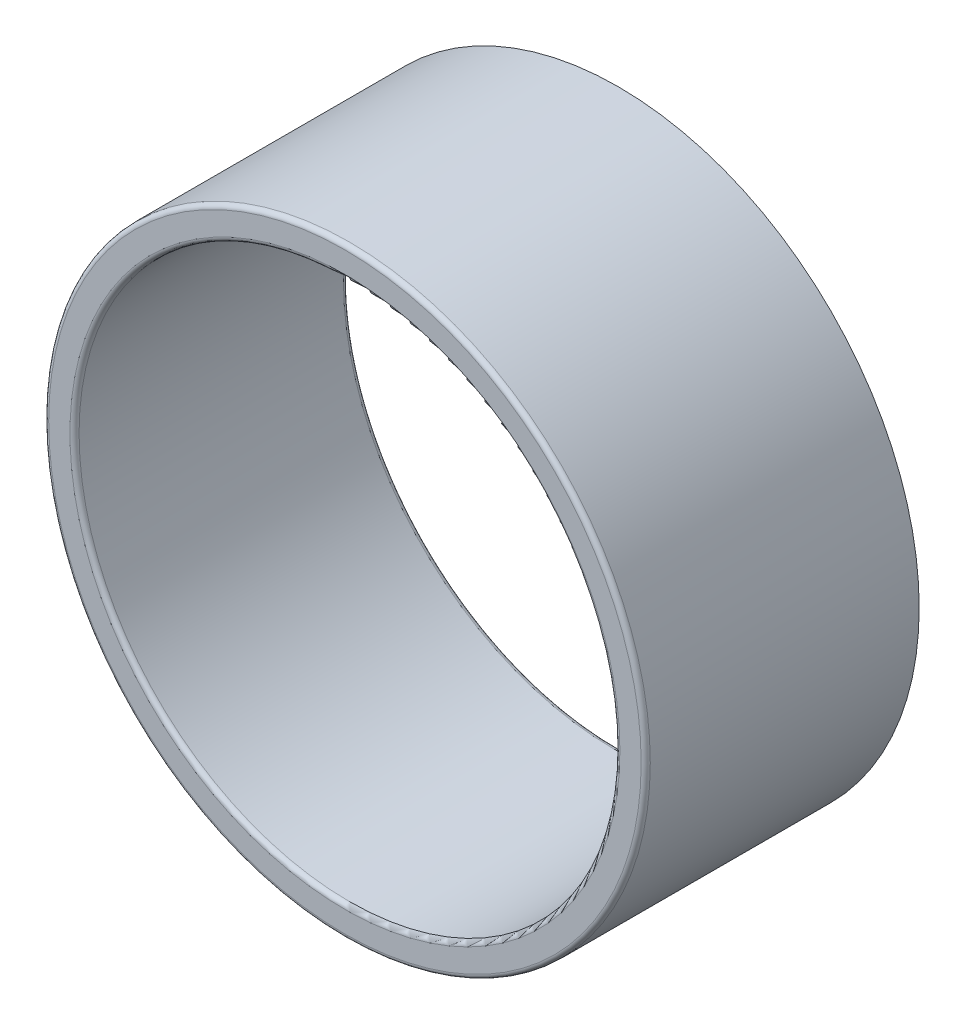
ISO-10303-21;
HEADER;
FILE_DESCRIPTION(('STEP AP214'),'2;1');
FILE_NAME('part.step','',(''),(''),'','','');
FILE_SCHEMA(('AUTOMOTIVE_DESIGN { 1 0 10303 214 1 1 1 1 }'));
ENDSEC;
DATA;
#1=APPLICATION_CONTEXT('core data for automotive mechanical design processes');
#2=APPLICATION_PROTOCOL_DEFINITION('international standard','automotive_design',2000,#1);
#3=PRODUCT_CONTEXT('',#1,'mechanical');
#4=PRODUCT('Part','Part','',(#3));
#5=PRODUCT_RELATED_PRODUCT_CATEGORY('part','',(#4));
#6=PRODUCT_DEFINITION_FORMATION('','',#4);
#7=PRODUCT_DEFINITION_CONTEXT('part definition',#1,'design');
#8=PRODUCT_DEFINITION('design','',#6,#7);
#9=PRODUCT_DEFINITION_SHAPE('','',#8);
#10=(LENGTH_UNIT() NAMED_UNIT(*) SI_UNIT(.MILLI.,.METRE.));
#11=(NAMED_UNIT(*) PLANE_ANGLE_UNIT() SI_UNIT($,.RADIAN.));
#12=(NAMED_UNIT(*) SI_UNIT($,.STERADIAN.) SOLID_ANGLE_UNIT());
#13=UNCERTAINTY_MEASURE_WITH_UNIT(LENGTH_MEASURE(1.E-05),#10,'distance_accuracy_value','');
#14=(GEOMETRIC_REPRESENTATION_CONTEXT(3) GLOBAL_UNCERTAINTY_ASSIGNED_CONTEXT((#13)) GLOBAL_UNIT_ASSIGNED_CONTEXT((#10,
#11,#12)) REPRESENTATION_CONTEXT('',''));
#15=CARTESIAN_POINT('',(0.,0.,0.));
#16=DIRECTION('',(0.,0.,1.));
#17=DIRECTION('',(1.,0.,0.));
#18=AXIS2_PLACEMENT_3D('',#15,#16,#17);
#19=CARTESIAN_POINT('',(232.735026918962,15.,-90.));
#20=DIRECTION('',(0.,0.,1.));
#21=DIRECTION('',(1.,0.,0.));
#22=AXIS2_PLACEMENT_3D('',#19,#20,#21);
#23=CYLINDRICAL_SURFACE('',#22,99.);
#24=CARTESIAN_POINT('',(232.735026918962,15.,-1.5));
#25=DIRECTION('',(0.,0.,1.));
#26=DIRECTION('',(1.,0.,0.));
#27=AXIS2_PLACEMENT_3D('',#24,#25,#26);
#28=CIRCLE('',#27,99.);
#29=CARTESIAN_POINT('',(331.735026918962,15.,-1.5));
#30=VERTEX_POINT('',#29);
#31=EDGE_CURVE('E55',#30,#30,#28,.F.);
#32=ORIENTED_EDGE('',*,*,#31,.T.);
#33=EDGE_LOOP('',(#32));
#34=FACE_BOUND('',#33,.T.);
#35=CARTESIAN_POINT('',(232.735026918962,15.,-90.));
#36=DIRECTION('',(0.,0.,1.));
#37=DIRECTION('',(1.,0.,0.));
#38=AXIS2_PLACEMENT_3D('',#35,#36,#37);
#39=CIRCLE('',#38,99.);
#40=CARTESIAN_POINT('',(331.735026918962,15.,-90.));
#41=VERTEX_POINT('',#40);
#42=EDGE_CURVE('E69',#41,#41,#39,.T.);
#43=ORIENTED_EDGE('',*,*,#42,.T.);
#44=EDGE_LOOP('',(#43));
#45=FACE_BOUND('',#44,.T.);
#46=ADVANCED_FACE('F37',(#34,#45),#23,.T.);
#47=CARTESIAN_POINT('',(232.735026918962,15.,-90.));
#48=DIRECTION('',(0.,0.,1.));
#49=DIRECTION('',(1.,0.,0.));
#50=AXIS2_PLACEMENT_3D('',#47,#48,#49);
#51=PLANE('',#50);
#52=CARTESIAN_POINT('',(232.735026918962,15.,-90.));
#53=DIRECTION('',(0.,0.,1.));
#54=DIRECTION('',(1.,0.,0.));
#55=AXIS2_PLACEMENT_3D('',#52,#53,#54);
#56=CIRCLE('',#55,90.5);
#57=CARTESIAN_POINT('',(323.235026918962,15.,-90.));
#58=VERTEX_POINT('',#57);
#59=EDGE_CURVE('E50',#58,#58,#56,.T.);
#60=ORIENTED_EDGE('',*,*,#59,.T.);
#61=EDGE_LOOP('',(#60));
#62=FACE_BOUND('',#61,.T.);
#63=ORIENTED_EDGE('',*,*,#42,.F.);
#64=EDGE_LOOP('',(#63));
#65=FACE_BOUND('',#64,.T.);
#66=ADVANCED_FACE('F75',(#62,#65),#51,.F.);
#67=CARTESIAN_POINT('',(232.735026918962,15.,0.));
#68=DIRECTION('',(0.,0.,1.));
#69=DIRECTION('',(1.,0.,0.));
#70=AXIS2_PLACEMENT_3D('',#67,#68,#69);
#71=PLANE('',#70);
#72=CARTESIAN_POINT('',(232.735026918962,15.,0.));
#73=DIRECTION('',(0.,0.,1.));
#74=DIRECTION('',(1.,0.,0.));
#75=AXIS2_PLACEMENT_3D('',#72,#73,#74);
#76=CIRCLE('',#75,97.5);
#77=CARTESIAN_POINT('',(330.235026918962,15.,0.));
#78=VERTEX_POINT('',#77);
#79=EDGE_CURVE('E61',#78,#78,#76,.T.);
#80=ORIENTED_EDGE('',*,*,#79,.T.);
#81=EDGE_LOOP('',(#80));
#82=FACE_BOUND('',#81,.T.);
#83=CARTESIAN_POINT('',(232.735026918962,15.,0.));
#84=DIRECTION('',(0.,0.,1.));
#85=DIRECTION('',(1.,0.,0.));
#86=AXIS2_PLACEMENT_3D('',#83,#84,#85);
#87=CIRCLE('',#86,90.5);
#88=CARTESIAN_POINT('',(323.235026918962,15.,0.));
#89=VERTEX_POINT('',#88);
#90=EDGE_CURVE('E65',#89,#89,#87,.F.);
#91=ORIENTED_EDGE('',*,*,#90,.T.);
#92=EDGE_LOOP('',(#91));
#93=FACE_BOUND('',#92,.T.);
#94=ADVANCED_FACE('F77',(#82,#93),#71,.T.);
#95=CARTESIAN_POINT('',(232.735026918962,15.,-90.));
#96=DIRECTION('',(0.,0.,1.));
#97=DIRECTION('',(1.,0.,0.));
#98=AXIS2_PLACEMENT_3D('',#95,#96,#97);
#99=CYLINDRICAL_SURFACE('',#98,89.);
#100=CARTESIAN_POINT('',(232.735026918962,15.,-88.5));
#101=DIRECTION('',(0.,0.,1.));
#102=DIRECTION('',(1.,0.,0.));
#103=AXIS2_PLACEMENT_3D('',#100,#101,#102);
#104=CIRCLE('',#103,89.);
#105=CARTESIAN_POINT('',(321.735026918962,15.,-88.5));
#106=VERTEX_POINT('',#105);
#107=EDGE_CURVE('E10',#106,#106,#104,.F.);
#108=ORIENTED_EDGE('',*,*,#107,.T.);
#109=EDGE_LOOP('',(#108));
#110=FACE_BOUND('',#109,.T.);
#111=CARTESIAN_POINT('',(232.735026918962,15.,-1.5));
#112=DIRECTION('',(0.,0.,1.));
#113=DIRECTION('',(1.,0.,0.));
#114=AXIS2_PLACEMENT_3D('',#111,#112,#113);
#115=CIRCLE('',#114,89.);
#116=CARTESIAN_POINT('',(321.735026918962,15.,-1.5));
#117=VERTEX_POINT('',#116);
#118=EDGE_CURVE('E45',#117,#117,#115,.T.);
#119=ORIENTED_EDGE('',*,*,#118,.T.);
#120=EDGE_LOOP('',(#119));
#121=FACE_BOUND('',#120,.T.);
#122=ADVANCED_FACE('F84',(#110,#121),#99,.F.);
#123=CARTESIAN_POINT('',(232.735026918962,15.,-1.5));
#124=DIRECTION('',(0.,0.,1.));
#125=DIRECTION('',(1.,0.,0.));
#126=AXIS2_PLACEMENT_3D('',#123,#124,#125);
#127=TOROIDAL_SURFACE('',#126,97.5,1.5);
#128=ORIENTED_EDGE('',*,*,#31,.F.);
#129=EDGE_LOOP('',(#128));
#130=FACE_BOUND('',#129,.T.);
#131=ORIENTED_EDGE('',*,*,#79,.F.);
#132=EDGE_LOOP('',(#131));
#133=FACE_BOUND('',#132,.T.);
#134=ADVANCED_FACE('F91',(#130,#133),#127,.T.);
#135=CARTESIAN_POINT('',(232.735026918962,15.,-88.5));
#136=DIRECTION('',(0.,0.,1.));
#137=DIRECTION('',(1.,0.,0.));
#138=AXIS2_PLACEMENT_3D('',#135,#136,#137);
#139=TOROIDAL_SURFACE('',#138,90.5,1.5);
#140=ORIENTED_EDGE('',*,*,#107,.F.);
#141=EDGE_LOOP('',(#140));
#142=FACE_BOUND('',#141,.T.);
#143=ORIENTED_EDGE('',*,*,#59,.F.);
#144=EDGE_LOOP('',(#143));
#145=FACE_BOUND('',#144,.T.);
#146=ADVANCED_FACE('F93',(#142,#145),#139,.T.);
#147=CARTESIAN_POINT('',(232.735026918962,15.,-1.5));
#148=DIRECTION('',(0.,0.,1.));
#149=DIRECTION('',(1.,0.,0.));
#150=AXIS2_PLACEMENT_3D('',#147,#148,#149);
#151=TOROIDAL_SURFACE('',#150,90.5,1.5);
#152=ORIENTED_EDGE('',*,*,#90,.F.);
#153=EDGE_LOOP('',(#152));
#154=FACE_BOUND('',#153,.T.);
#155=ORIENTED_EDGE('',*,*,#118,.F.);
#156=EDGE_LOOP('',(#155));
#157=FACE_BOUND('',#156,.T.);
#158=ADVANCED_FACE('F39',(#154,#157),#151,.T.);
#159=CLOSED_SHELL('',(#46,#66,#94,#122,#134,#146,#158));
#160=MANIFOLD_SOLID_BREP('B2',#159);
#161=ADVANCED_BREP_SHAPE_REPRESENTATION('',(#18,#160),#14);
#162=SHAPE_DEFINITION_REPRESENTATION(#9,#161);
ENDSEC;
END-ISO-10303-21;
